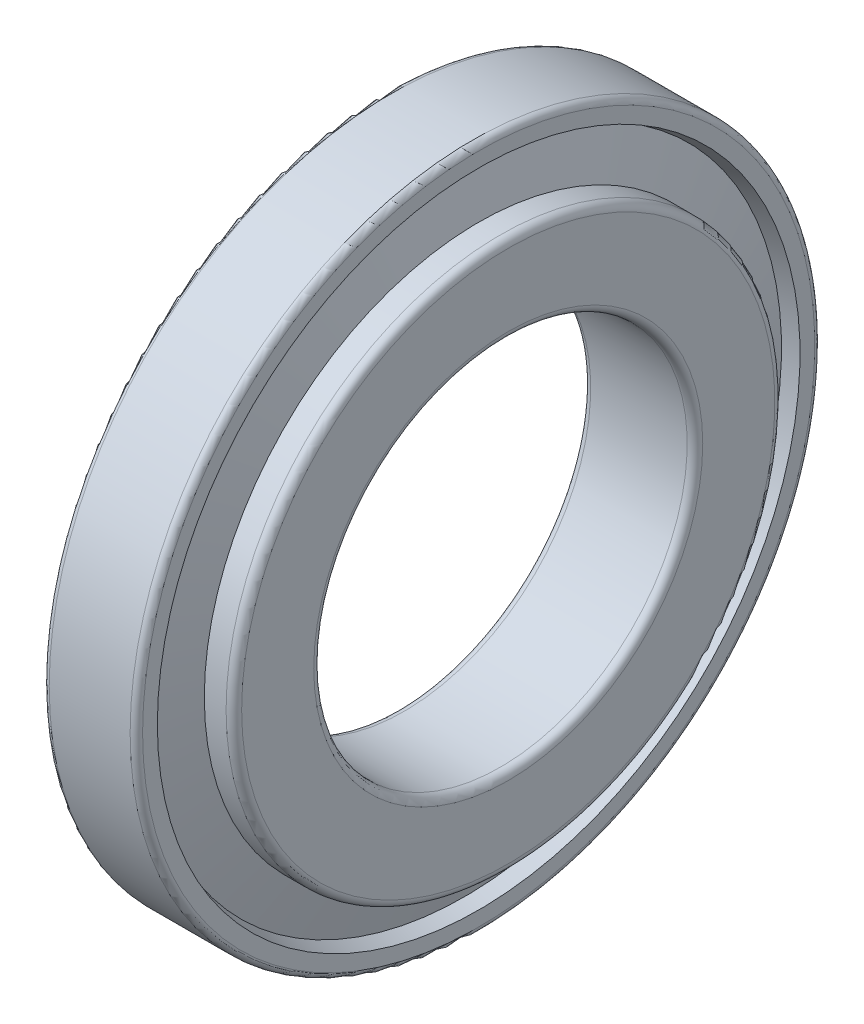
ISO-10303-21;
HEADER;
FILE_DESCRIPTION(('STEP AP214'),'2;1');
FILE_NAME('part.step','',(''),(''),'','','');
FILE_SCHEMA(('AUTOMOTIVE_DESIGN { 1 0 10303 214 1 1 1 1 }'));
ENDSEC;
DATA;
#1=APPLICATION_CONTEXT('core data for automotive mechanical design processes');
#2=APPLICATION_PROTOCOL_DEFINITION('international standard','automotive_design',2000,#1);
#3=PRODUCT_CONTEXT('',#1,'mechanical');
#4=PRODUCT('Part','Part','',(#3));
#5=PRODUCT_RELATED_PRODUCT_CATEGORY('part','',(#4));
#6=PRODUCT_DEFINITION_FORMATION('','',#4);
#7=PRODUCT_DEFINITION_CONTEXT('part definition',#1,'design');
#8=PRODUCT_DEFINITION('design','',#6,#7);
#9=PRODUCT_DEFINITION_SHAPE('','',#8);
#10=(LENGTH_UNIT() NAMED_UNIT(*) SI_UNIT(.MILLI.,.METRE.));
#11=(NAMED_UNIT(*) PLANE_ANGLE_UNIT() SI_UNIT($,.RADIAN.));
#12=(NAMED_UNIT(*) SI_UNIT($,.STERADIAN.) SOLID_ANGLE_UNIT());
#13=UNCERTAINTY_MEASURE_WITH_UNIT(LENGTH_MEASURE(1.E-05),#10,'distance_accuracy_value','');
#14=(GEOMETRIC_REPRESENTATION_CONTEXT(3) GLOBAL_UNCERTAINTY_ASSIGNED_CONTEXT((#13)) GLOBAL_UNIT_ASSIGNED_CONTEXT((#10,
#11,#12)) REPRESENTATION_CONTEXT('',''));
#15=CARTESIAN_POINT('',(0.,0.,0.));
#16=DIRECTION('',(0.,0.,1.));
#17=DIRECTION('',(1.,0.,0.));
#18=AXIS2_PLACEMENT_3D('',#15,#16,#17);
#19=CARTESIAN_POINT('',(15.3617724443369,0.,0.));
#20=DIRECTION('',(-1.,0.,0.));
#21=DIRECTION('',(0.,0.,1.));
#22=AXIS2_PLACEMENT_3D('',#19,#20,#21);
#23=CONICAL_SURFACE('',#22,192.358196828099,1.2977880466885);
#24=CARTESIAN_POINT('',(23.7235448886737,0.,0.));
#25=DIRECTION('',(-1.,0.,0.));
#26=DIRECTION('',(0.,0.,1.));
#27=AXIS2_PLACEMENT_3D('',#24,#25,#26);
#28=CIRCLE('',#27,162.494675162597);
#29=CARTESIAN_POINT('',(23.7235448886737,0.,162.494675162597));
#30=VERTEX_POINT('',#29);
#31=EDGE_CURVE('E112',#30,#30,#28,.T.);
#32=ORIENTED_EDGE('',*,*,#31,.F.);
#33=EDGE_LOOP('',(#32));
#34=FACE_BOUND('',#33,.T.);
#35=CARTESIAN_POINT('',(15.3617724443369,0.,0.));
#36=DIRECTION('',(-1.,0.,0.));
#37=DIRECTION('',(0.,0.,1.));
#38=AXIS2_PLACEMENT_3D('',#35,#36,#37);
#39=CIRCLE('',#38,192.358196828099);
#40=CARTESIAN_POINT('',(15.3617724443369,0.,192.358196828099));
#41=VERTEX_POINT('',#40);
#42=EDGE_CURVE('E10',#41,#41,#39,.T.);
#43=ORIENTED_EDGE('',*,*,#42,.T.);
#44=EDGE_LOOP('',(#43));
#45=FACE_BOUND('',#44,.T.);
#46=ADVANCED_FACE('F37',(#34,#45),#23,.F.);
#47=CARTESIAN_POINT('',(0.,0.,0.));
#48=DIRECTION('',(1.,0.,0.));
#49=DIRECTION('',(0.,0.,-1.));
#50=AXIS2_PLACEMENT_3D('',#47,#48,#49);
#51=CONICAL_SURFACE('',#50,187.488,0.307009705190274);
#52=ORIENTED_EDGE('',*,*,#42,.F.);
#53=EDGE_LOOP('',(#52));
#54=FACE_BOUND('',#53,.T.);
#55=CARTESIAN_POINT('',(0.,0.,0.));
#56=DIRECTION('',(-1.,0.,0.));
#57=DIRECTION('',(0.,0.,1.));
#58=AXIS2_PLACEMENT_3D('',#55,#56,#57);
#59=CIRCLE('',#58,187.488);
#60=CARTESIAN_POINT('',(0.,0.,187.488));
#61=VERTEX_POINT('',#60);
#62=EDGE_CURVE('E44',#61,#61,#59,.T.);
#63=ORIENTED_EDGE('',*,*,#62,.T.);
#64=EDGE_LOOP('',(#63));
#65=FACE_BOUND('',#64,.T.);
#66=ADVANCED_FACE('F120',(#54,#65),#51,.F.);
#67=CARTESIAN_POINT('',(0.,187.488,0.));
#68=DIRECTION('',(1.,0.,0.));
#69=DIRECTION('',(0.,0.,-1.));
#70=AXIS2_PLACEMENT_3D('',#67,#68,#69);
#71=PLANE('',#70);
#72=ORIENTED_EDGE('',*,*,#62,.F.);
#73=EDGE_LOOP('',(#72));
#74=FACE_BOUND('',#73,.T.);
#75=CARTESIAN_POINT('',(0.,0.,0.));
#76=DIRECTION('',(-1.,0.,0.));
#77=DIRECTION('',(0.,0.,1.));
#78=AXIS2_PLACEMENT_3D('',#75,#76,#77);
#79=CIRCLE('',#78,216.);
#80=CARTESIAN_POINT('',(0.,0.,216.));
#81=VERTEX_POINT('',#80);
#82=EDGE_CURVE('E49',#81,#81,#79,.T.);
#83=ORIENTED_EDGE('',*,*,#82,.T.);
#84=EDGE_LOOP('',(#83));
#85=FACE_BOUND('',#84,.T.);
#86=ADVANCED_FACE('F124',(#74,#85),#71,.F.);
#87=CARTESIAN_POINT('',(4.,0.,0.));
#88=DIRECTION('',(-1.,0.,0.));
#89=DIRECTION('',(0.,0.,1.));
#90=AXIS2_PLACEMENT_3D('',#87,#88,#89);
#91=TOROIDAL_SURFACE('',#90,216.,4.00000000000002);
#92=ORIENTED_EDGE('',*,*,#82,.F.);
#93=EDGE_LOOP('',(#92));
#94=FACE_BOUND('',#93,.T.);
#95=CARTESIAN_POINT('',(4.,0.,0.));
#96=DIRECTION('',(-1.,0.,0.));
#97=DIRECTION('',(0.,0.,1.));
#98=AXIS2_PLACEMENT_3D('',#95,#96,#97);
#99=CIRCLE('',#98,220.);
#100=CARTESIAN_POINT('',(4.,0.,220.));
#101=VERTEX_POINT('',#100);
#102=EDGE_CURVE('E54',#101,#101,#99,.T.);
#103=ORIENTED_EDGE('',*,*,#102,.T.);
#104=EDGE_LOOP('',(#103));
#105=FACE_BOUND('',#104,.T.);
#106=ADVANCED_FACE('F129',(#94,#105),#91,.T.);
#107=CARTESIAN_POINT('',(-882.527700014444,0.,0.));
#108=DIRECTION('',(-1.,0.,0.));
#109=DIRECTION('',(0.,0.,1.));
#110=AXIS2_PLACEMENT_3D('',#107,#108,#109);
#111=CYLINDRICAL_SURFACE('',#110,220.);
#112=ORIENTED_EDGE('',*,*,#102,.F.);
#113=EDGE_LOOP('',(#112));
#114=FACE_BOUND('',#113,.T.);
#115=CARTESIAN_POINT('',(56.,0.,0.));
#116=DIRECTION('',(-1.,0.,0.));
#117=DIRECTION('',(0.,0.,1.));
#118=AXIS2_PLACEMENT_3D('',#115,#116,#117);
#119=CIRCLE('',#118,220.);
#120=CARTESIAN_POINT('',(56.,0.,220.));
#121=VERTEX_POINT('',#120);
#122=EDGE_CURVE('E60',#121,#121,#119,.T.);
#123=ORIENTED_EDGE('',*,*,#122,.T.);
#124=EDGE_LOOP('',(#123));
#125=FACE_BOUND('',#124,.T.);
#126=ADVANCED_FACE('F135',(#114,#125),#111,.T.);
#127=CARTESIAN_POINT('',(56.,0.,0.));
#128=DIRECTION('',(-1.,0.,0.));
#129=DIRECTION('',(0.,0.,1.));
#130=AXIS2_PLACEMENT_3D('',#127,#128,#129);
#131=TOROIDAL_SURFACE('',#130,216.,4.00000000000001);
#132=ORIENTED_EDGE('',*,*,#122,.F.);
#133=EDGE_LOOP('',(#132));
#134=FACE_BOUND('',#133,.T.);
#135=CARTESIAN_POINT('',(60.0000000000001,0.,0.));
#136=DIRECTION('',(-1.,0.,0.));
#137=DIRECTION('',(0.,0.,1.));
#138=AXIS2_PLACEMENT_3D('',#135,#136,#137);
#139=CIRCLE('',#138,216.);
#140=CARTESIAN_POINT('',(60.0000000000001,0.,216.));
#141=VERTEX_POINT('',#140);
#142=EDGE_CURVE('E64',#141,#141,#139,.T.);
#143=ORIENTED_EDGE('',*,*,#142,.T.);
#144=EDGE_LOOP('',(#143));
#145=FACE_BOUND('',#144,.T.);
#146=ADVANCED_FACE('F139',(#134,#145),#131,.T.);
#147=CARTESIAN_POINT('',(60.,216.,0.));
#148=DIRECTION('',(-1.,0.,0.));
#149=DIRECTION('',(0.,0.,1.));
#150=AXIS2_PLACEMENT_3D('',#147,#148,#149);
#151=PLANE('',#150);
#152=ORIENTED_EDGE('',*,*,#142,.F.);
#153=EDGE_LOOP('',(#152));
#154=FACE_BOUND('',#153,.T.);
#155=CARTESIAN_POINT('',(60.0000000000001,0.,0.));
#156=DIRECTION('',(-1.,0.,0.));
#157=DIRECTION('',(0.,0.,1.));
#158=AXIS2_PLACEMENT_3D('',#155,#156,#157);
#159=CIRCLE('',#158,206.510011343078);
#160=CARTESIAN_POINT('',(60.0000000000001,0.,206.510011343078));
#161=VERTEX_POINT('',#160);
#162=EDGE_CURVE('E68',#161,#161,#159,.T.);
#163=ORIENTED_EDGE('',*,*,#162,.T.);
#164=EDGE_LOOP('',(#163));
#165=FACE_BOUND('',#164,.T.);
#166=ADVANCED_FACE('F143',(#154,#165),#151,.F.);
#167=CARTESIAN_POINT('',(50.953748731252,0.,0.));
#168=DIRECTION('',(1.,0.,0.));
#169=DIRECTION('',(0.,0.,-1.));
#170=AXIS2_PLACEMENT_3D('',#167,#168,#169);
#171=CONICAL_SURFACE('',#170,203.64204643897,0.307009705190274);
#172=ORIENTED_EDGE('',*,*,#162,.F.);
#173=EDGE_LOOP('',(#172));
#174=FACE_BOUND('',#173,.T.);
#175=CARTESIAN_POINT('',(50.953748731252,0.,0.));
#176=DIRECTION('',(-1.,0.,0.));
#177=DIRECTION('',(0.,0.,1.));
#178=AXIS2_PLACEMENT_3D('',#175,#176,#177);
#179=CIRCLE('',#178,203.64204643897);
#180=CARTESIAN_POINT('',(50.953748731252,0.,203.64204643897));
#181=VERTEX_POINT('',#180);
#182=EDGE_CURVE('E72',#181,#181,#179,.T.);
#183=ORIENTED_EDGE('',*,*,#182,.T.);
#184=EDGE_LOOP('',(#183));
#185=FACE_BOUND('',#184,.T.);
#186=ADVANCED_FACE('F147',(#174,#185),#171,.F.);
#187=CARTESIAN_POINT('',(60.0000000000001,0.,0.));
#188=DIRECTION('',(-1.,0.,0.));
#189=DIRECTION('',(0.,0.,1.));
#190=AXIS2_PLACEMENT_3D('',#187,#188,#189);
#191=CONICAL_SURFACE('',#190,171.33395356103,1.29778804668849);
#192=ORIENTED_EDGE('',*,*,#182,.F.);
#193=EDGE_LOOP('',(#192));
#194=FACE_BOUND('',#193,.T.);
#195=CARTESIAN_POINT('',(60.0000000000001,0.,0.));
#196=DIRECTION('',(-1.,0.,0.));
#197=DIRECTION('',(0.,0.,1.));
#198=AXIS2_PLACEMENT_3D('',#195,#196,#197);
#199=CIRCLE('',#198,171.33395356103);
#200=CARTESIAN_POINT('',(60.0000000000001,0.,171.33395356103));
#201=VERTEX_POINT('',#200);
#202=EDGE_CURVE('E76',#201,#201,#199,.T.);
#203=ORIENTED_EDGE('',*,*,#202,.T.);
#204=EDGE_LOOP('',(#203));
#205=FACE_BOUND('',#204,.T.);
#206=ADVANCED_FACE('F151',(#194,#205),#191,.T.);
#207=CARTESIAN_POINT('',(60.,176.33395356103,0.));
#208=DIRECTION('',(1.,0.,0.));
#209=DIRECTION('',(0.,0.,-1.));
#210=AXIS2_PLACEMENT_3D('',#207,#208,#209);
#211=PLANE('',#210);
#212=ORIENTED_EDGE('',*,*,#202,.F.);
#213=EDGE_LOOP('',(#212));
#214=FACE_BOUND('',#213,.T.);
#215=CARTESIAN_POINT('',(60.0000000000001,0.,0.));
#216=DIRECTION('',(-1.,0.,0.));
#217=DIRECTION('',(0.,0.,1.));
#218=AXIS2_PLACEMENT_3D('',#215,#216,#217);
#219=CIRCLE('',#218,176.33395356103);
#220=CARTESIAN_POINT('',(60.0000000000001,0.,176.33395356103));
#221=VERTEX_POINT('',#220);
#222=EDGE_CURVE('E80',#221,#221,#219,.T.);
#223=ORIENTED_EDGE('',*,*,#222,.T.);
#224=EDGE_LOOP('',(#223));
#225=FACE_BOUND('',#224,.T.);
#226=ADVANCED_FACE('F155',(#214,#225),#211,.F.);
#227=CARTESIAN_POINT('',(-882.527700014444,0.,0.));
#228=DIRECTION('',(-1.,0.,0.));
#229=DIRECTION('',(0.,0.,1.));
#230=AXIS2_PLACEMENT_3D('',#227,#228,#229);
#231=CYLINDRICAL_SURFACE('',#230,176.33395356103);
#232=ORIENTED_EDGE('',*,*,#222,.F.);
#233=EDGE_LOOP('',(#232));
#234=FACE_BOUND('',#233,.T.);
#235=CARTESIAN_POINT('',(74.,0.,0.));
#236=DIRECTION('',(-1.,0.,0.));
#237=DIRECTION('',(0.,0.,1.));
#238=AXIS2_PLACEMENT_3D('',#235,#236,#237);
#239=CIRCLE('',#238,176.33395356103);
#240=CARTESIAN_POINT('',(74.,0.,176.33395356103));
#241=VERTEX_POINT('',#240);
#242=EDGE_CURVE('E84',#241,#241,#239,.T.);
#243=ORIENTED_EDGE('',*,*,#242,.T.);
#244=EDGE_LOOP('',(#243));
#245=FACE_BOUND('',#244,.T.);
#246=ADVANCED_FACE('F159',(#234,#245),#231,.T.);
#247=CARTESIAN_POINT('',(74.,0.,0.));
#248=DIRECTION('',(-1.,0.,0.));
#249=DIRECTION('',(0.,0.,1.));
#250=AXIS2_PLACEMENT_3D('',#247,#248,#249);
#251=TOROIDAL_SURFACE('',#250,171.33395356103,5.00000000000001);
#252=ORIENTED_EDGE('',*,*,#242,.F.);
#253=EDGE_LOOP('',(#252));
#254=FACE_BOUND('',#253,.T.);
#255=CARTESIAN_POINT('',(79.,0.,0.));
#256=DIRECTION('',(-1.,0.,0.));
#257=DIRECTION('',(0.,0.,1.));
#258=AXIS2_PLACEMENT_3D('',#255,#256,#257);
#259=CIRCLE('',#258,171.33395356103);
#260=CARTESIAN_POINT('',(79.,0.,171.33395356103));
#261=VERTEX_POINT('',#260);
#262=EDGE_CURVE('E88',#261,#261,#259,.T.);
#263=ORIENTED_EDGE('',*,*,#262,.T.);
#264=EDGE_LOOP('',(#263));
#265=FACE_BOUND('',#264,.T.);
#266=ADVANCED_FACE('F163',(#254,#265),#251,.T.);
#267=CARTESIAN_POINT('',(79.,125.,0.));
#268=DIRECTION('',(-1.,0.,0.));
#269=DIRECTION('',(0.,0.,1.));
#270=AXIS2_PLACEMENT_3D('',#267,#268,#269);
#271=PLANE('',#270);
#272=ORIENTED_EDGE('',*,*,#262,.F.);
#273=EDGE_LOOP('',(#272));
#274=FACE_BOUND('',#273,.T.);
#275=CARTESIAN_POINT('',(79.,0.,0.));
#276=DIRECTION('',(-1.,0.,0.));
#277=DIRECTION('',(0.,0.,1.));
#278=AXIS2_PLACEMENT_3D('',#275,#276,#277);
#279=CIRCLE('',#278,125.);
#280=CARTESIAN_POINT('',(79.,0.,125.));
#281=VERTEX_POINT('',#280);
#282=EDGE_CURVE('E92',#281,#281,#279,.T.);
#283=ORIENTED_EDGE('',*,*,#282,.T.);
#284=EDGE_LOOP('',(#283));
#285=FACE_BOUND('',#284,.T.);
#286=ADVANCED_FACE('F167',(#274,#285),#271,.F.);
#287=CARTESIAN_POINT('',(74.,0.,0.));
#288=DIRECTION('',(-1.,0.,0.));
#289=DIRECTION('',(0.,0.,1.));
#290=AXIS2_PLACEMENT_3D('',#287,#288,#289);
#291=TOROIDAL_SURFACE('',#290,125.,5.);
#292=ORIENTED_EDGE('',*,*,#282,.F.);
#293=EDGE_LOOP('',(#292));
#294=FACE_BOUND('',#293,.T.);
#295=CARTESIAN_POINT('',(74.,0.,0.));
#296=DIRECTION('',(-1.,0.,0.));
#297=DIRECTION('',(0.,0.,1.));
#298=AXIS2_PLACEMENT_3D('',#295,#296,#297);
#299=CIRCLE('',#298,120.);
#300=CARTESIAN_POINT('',(74.,0.,120.));
#301=VERTEX_POINT('',#300);
#302=EDGE_CURVE('E96',#301,#301,#299,.T.);
#303=ORIENTED_EDGE('',*,*,#302,.T.);
#304=EDGE_LOOP('',(#303));
#305=FACE_BOUND('',#304,.T.);
#306=ADVANCED_FACE('F171',(#294,#305),#291,.T.);
#307=CARTESIAN_POINT('',(-882.527700014444,0.,0.));
#308=DIRECTION('',(-1.,0.,0.));
#309=DIRECTION('',(0.,0.,1.));
#310=AXIS2_PLACEMENT_3D('',#307,#308,#309);
#311=CYLINDRICAL_SURFACE('',#310,120.);
#312=ORIENTED_EDGE('',*,*,#302,.F.);
#313=EDGE_LOOP('',(#312));
#314=FACE_BOUND('',#313,.T.);
#315=CARTESIAN_POINT('',(12.,0.,0.));
#316=DIRECTION('',(-1.,0.,0.));
#317=DIRECTION('',(0.,0.,1.));
#318=AXIS2_PLACEMENT_3D('',#315,#316,#317);
#319=CIRCLE('',#318,120.);
#320=CARTESIAN_POINT('',(12.,0.,120.));
#321=VERTEX_POINT('',#320);
#322=EDGE_CURVE('E100',#321,#321,#319,.T.);
#323=ORIENTED_EDGE('',*,*,#322,.T.);
#324=EDGE_LOOP('',(#323));
#325=FACE_BOUND('',#324,.T.);
#326=ADVANCED_FACE('F175',(#314,#325),#311,.F.);
#327=CARTESIAN_POINT('',(12.,0.,0.));
#328=DIRECTION('',(-1.,0.,0.));
#329=DIRECTION('',(0.,0.,1.));
#330=AXIS2_PLACEMENT_3D('',#327,#328,#329);
#331=TOROIDAL_SURFACE('',#330,125.,5.);
#332=ORIENTED_EDGE('',*,*,#322,.F.);
#333=EDGE_LOOP('',(#332));
#334=FACE_BOUND('',#333,.T.);
#335=CARTESIAN_POINT('',(7.00000000000001,0.,0.));
#336=DIRECTION('',(-1.,0.,0.));
#337=DIRECTION('',(0.,0.,1.));
#338=AXIS2_PLACEMENT_3D('',#335,#336,#337);
#339=CIRCLE('',#338,125.);
#340=CARTESIAN_POINT('',(7.00000000000001,0.,125.));
#341=VERTEX_POINT('',#340);
#342=EDGE_CURVE('E104',#341,#341,#339,.T.);
#343=ORIENTED_EDGE('',*,*,#342,.T.);
#344=EDGE_LOOP('',(#343));
#345=FACE_BOUND('',#344,.T.);
#346=ADVANCED_FACE('F179',(#334,#345),#331,.T.);
#347=CARTESIAN_POINT('',(7.00000000000001,162.494675162597,0.));
#348=DIRECTION('',(1.,0.,0.));
#349=DIRECTION('',(0.,0.,-1.));
#350=AXIS2_PLACEMENT_3D('',#347,#348,#349);
#351=PLANE('',#350);
#352=ORIENTED_EDGE('',*,*,#342,.F.);
#353=EDGE_LOOP('',(#352));
#354=FACE_BOUND('',#353,.T.);
#355=CARTESIAN_POINT('',(7.00000000000001,0.,0.));
#356=DIRECTION('',(-1.,0.,0.));
#357=DIRECTION('',(0.,0.,1.));
#358=AXIS2_PLACEMENT_3D('',#355,#356,#357);
#359=CIRCLE('',#358,162.494675162597);
#360=CARTESIAN_POINT('',(7.00000000000001,0.,162.494675162597));
#361=VERTEX_POINT('',#360);
#362=EDGE_CURVE('E108',#361,#361,#359,.T.);
#363=ORIENTED_EDGE('',*,*,#362,.T.);
#364=EDGE_LOOP('',(#363));
#365=FACE_BOUND('',#364,.T.);
#366=ADVANCED_FACE('F183',(#354,#365),#351,.F.);
#367=CARTESIAN_POINT('',(-882.527700014444,0.,0.));
#368=DIRECTION('',(-1.,0.,0.));
#369=DIRECTION('',(0.,0.,1.));
#370=AXIS2_PLACEMENT_3D('',#367,#368,#369);
#371=CYLINDRICAL_SURFACE('',#370,162.494675162597);
#372=ORIENTED_EDGE('',*,*,#362,.F.);
#373=EDGE_LOOP('',(#372));
#374=FACE_BOUND('',#373,.T.);
#375=ORIENTED_EDGE('',*,*,#31,.T.);
#376=EDGE_LOOP('',(#375));
#377=FACE_BOUND('',#376,.T.);
#378=ADVANCED_FACE('F117',(#374,#377),#371,.T.);
#379=CLOSED_SHELL('',(#46,#66,#86,#106,#126,#146,#166,#186,#206,#226,#246,#266,#286,#306,#326,
#346,#366,#378));
#380=MANIFOLD_SOLID_BREP('B2',#379);
#381=ADVANCED_BREP_SHAPE_REPRESENTATION('',(#18,#380),#14);
#382=SHAPE_DEFINITION_REPRESENTATION(#9,#381);
ENDSEC;
END-ISO-10303-21;
